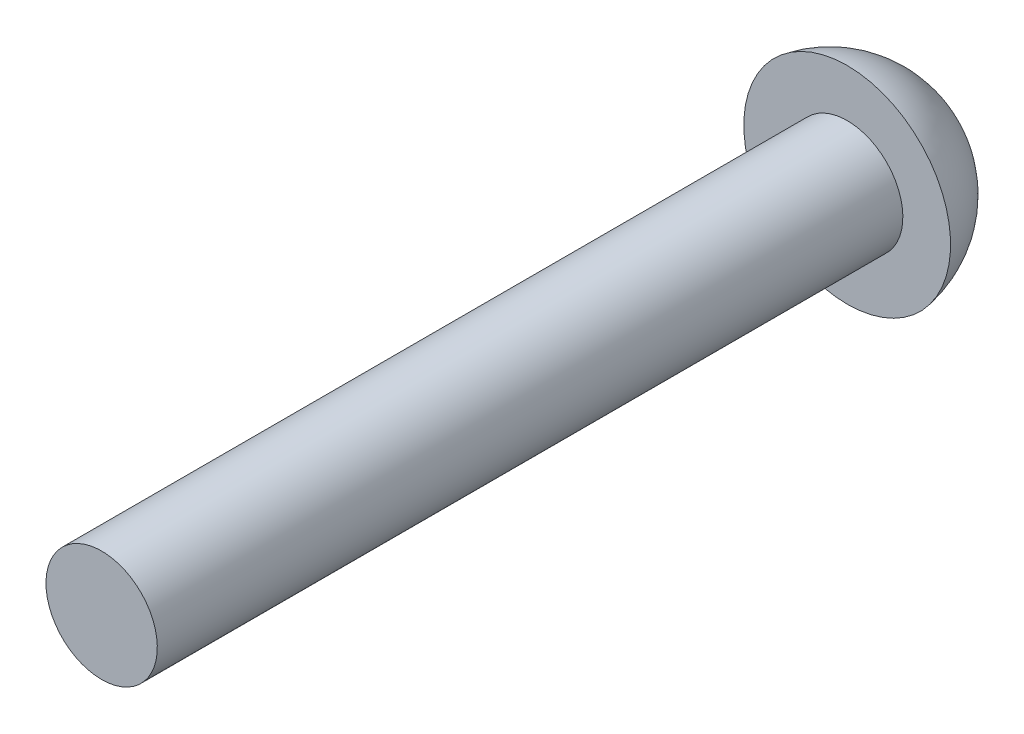
ISO-10303-21;
HEADER;
FILE_DESCRIPTION(('STEP AP214'),'2;1');
FILE_NAME('part.step','',(''),(''),'','','');
FILE_SCHEMA(('AUTOMOTIVE_DESIGN { 1 0 10303 214 1 1 1 1 }'));
ENDSEC;
DATA;
#1=APPLICATION_CONTEXT('core data for automotive mechanical design processes');
#2=APPLICATION_PROTOCOL_DEFINITION('international standard','automotive_design',2000,#1);
#3=PRODUCT_CONTEXT('',#1,'mechanical');
#4=PRODUCT('Part','Part','',(#3));
#5=PRODUCT_RELATED_PRODUCT_CATEGORY('part','',(#4));
#6=PRODUCT_DEFINITION_FORMATION('','',#4);
#7=PRODUCT_DEFINITION_CONTEXT('part definition',#1,'design');
#8=PRODUCT_DEFINITION('design','',#6,#7);
#9=PRODUCT_DEFINITION_SHAPE('','',#8);
#10=(LENGTH_UNIT() NAMED_UNIT(*) SI_UNIT(.MILLI.,.METRE.));
#11=(NAMED_UNIT(*) PLANE_ANGLE_UNIT() SI_UNIT($,.RADIAN.));
#12=(NAMED_UNIT(*) SI_UNIT($,.STERADIAN.) SOLID_ANGLE_UNIT());
#13=UNCERTAINTY_MEASURE_WITH_UNIT(LENGTH_MEASURE(1.E-05),#10,'distance_accuracy_value','');
#14=(GEOMETRIC_REPRESENTATION_CONTEXT(3) GLOBAL_UNCERTAINTY_ASSIGNED_CONTEXT((#13)) GLOBAL_UNIT_ASSIGNED_CONTEXT((#10,
#11,#12)) REPRESENTATION_CONTEXT('',''));
#15=CARTESIAN_POINT('',(0.,0.,0.));
#16=DIRECTION('',(0.,0.,1.));
#17=DIRECTION('',(1.,0.,0.));
#18=AXIS2_PLACEMENT_3D('',#15,#16,#17);
#19=CARTESIAN_POINT('',(0.,0.,-18.6066545454545));
#20=DIRECTION('',(0.,0.,1.));
#21=DIRECTION('',(0.,1.,0.));
#22=AXIS2_PLACEMENT_3D('',#19,#20,#21);
#23=SPHERICAL_SURFACE('',#22,2.67854545454545);
#24=CARTESIAN_POINT('',(0.,0.,-19.05));
#25=DIRECTION('',(0.,0.,1.));
#26=DIRECTION('',(0.,-1.,0.));
#27=AXIS2_PLACEMENT_3D('',#24,#25,#26);
#28=CIRCLE('',#27,2.6416);
#29=CARTESIAN_POINT('',(0.,-2.6416,-19.05));
#30=VERTEX_POINT('',#29);
#31=EDGE_CURVE('E10',#30,#30,#28,.T.);
#32=ORIENTED_EDGE('',*,*,#31,.F.);
#33=EDGE_LOOP('',(#32));
#34=FACE_BOUND('',#33,.T.);
#35=ADVANCED_FACE('F358',(#34),#23,.T.);
#36=CARTESIAN_POINT('',(0.,1.4224,-19.05));
#37=DIRECTION('',(0.,0.,-1.));
#38=DIRECTION('',(0.,1.,0.));
#39=AXIS2_PLACEMENT_3D('',#36,#37,#38);
#40=PLANE('',#39);
#41=CARTESIAN_POINT('',(0.,0.,-19.05));
#42=DIRECTION('',(0.,0.,1.));
#43=DIRECTION('',(0.,-1.,0.));
#44=AXIS2_PLACEMENT_3D('',#41,#42,#43);
#45=CIRCLE('',#44,1.4224);
#46=CARTESIAN_POINT('',(0.,-1.4224,-19.05));
#47=VERTEX_POINT('',#46);
#48=EDGE_CURVE('E364',#47,#47,#45,.T.);
#49=ORIENTED_EDGE('',*,*,#48,.F.);
#50=EDGE_LOOP('',(#49));
#51=FACE_BOUND('',#50,.T.);
#52=ORIENTED_EDGE('',*,*,#31,.T.);
#53=EDGE_LOOP('',(#52));
#54=FACE_BOUND('',#53,.T.);
#55=ADVANCED_FACE('F379',(#51,#54),#40,.F.);
#56=CARTESIAN_POINT('',(0.,0.,0.));
#57=DIRECTION('',(0.,0.,1.));
#58=DIRECTION('',(0.,-1.,0.));
#59=AXIS2_PLACEMENT_3D('',#56,#57,#58);
#60=CYLINDRICAL_SURFACE('',#59,1.4224);
#61=CARTESIAN_POINT('',(0.,0.,0.));
#62=DIRECTION('',(0.,0.,1.));
#63=DIRECTION('',(0.,-1.,0.));
#64=AXIS2_PLACEMENT_3D('',#61,#62,#63);
#65=CIRCLE('',#64,1.4224);
#66=CARTESIAN_POINT('',(0.,-1.4224,0.));
#67=VERTEX_POINT('',#66);
#68=EDGE_CURVE('E368',#67,#67,#65,.T.);
#69=ORIENTED_EDGE('',*,*,#68,.F.);
#70=EDGE_LOOP('',(#69));
#71=FACE_BOUND('',#70,.T.);
#72=ORIENTED_EDGE('',*,*,#48,.T.);
#73=EDGE_LOOP('',(#72));
#74=FACE_BOUND('',#73,.T.);
#75=ADVANCED_FACE('F377',(#71,#74),#60,.T.);
#76=CARTESIAN_POINT('',(0.,0.,0.));
#77=DIRECTION('',(0.,0.,-1.));
#78=DIRECTION('',(0.,1.,0.));
#79=AXIS2_PLACEMENT_3D('',#76,#77,#78);
#80=PLANE('',#79);
#81=ORIENTED_EDGE('',*,*,#68,.T.);
#82=EDGE_LOOP('',(#81));
#83=FACE_BOUND('',#82,.T.);
#84=ADVANCED_FACE('F375',(#83),#80,.F.);
#85=CLOSED_SHELL('',(#35,#55,#75,#84));
#86=MANIFOLD_SOLID_BREP('B2',#85);
#87=ADVANCED_BREP_SHAPE_REPRESENTATION('',(#18,#86),#14);
#88=SHAPE_DEFINITION_REPRESENTATION(#9,#87);
ENDSEC;
END-ISO-10303-21;
